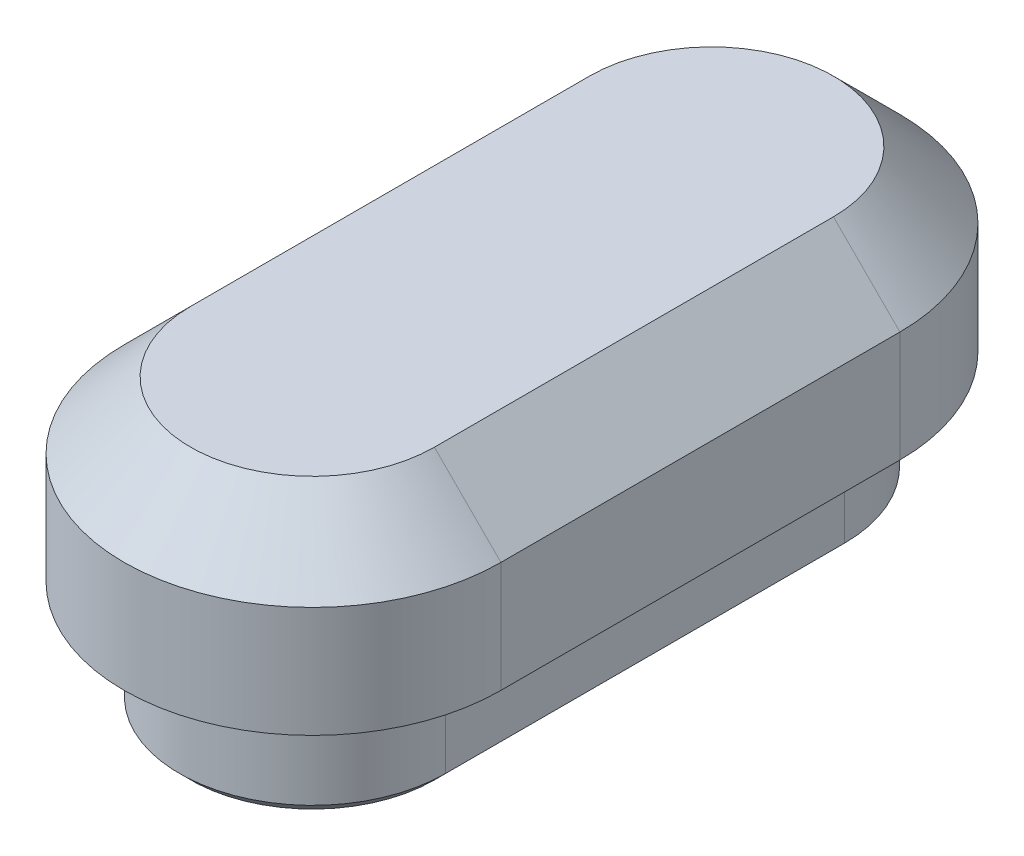
ISO-10303-21;
HEADER;
FILE_DESCRIPTION(('STEP AP214'),'2;1');
FILE_NAME('part.step','',(''),(''),'','','');
FILE_SCHEMA(('AUTOMOTIVE_DESIGN { 1 0 10303 214 1 1 1 1 }'));
ENDSEC;
DATA;
#1=APPLICATION_CONTEXT('core data for automotive mechanical design processes');
#2=APPLICATION_PROTOCOL_DEFINITION('international standard','automotive_design',2000,#1);
#3=PRODUCT_CONTEXT('',#1,'mechanical');
#4=PRODUCT('Part','Part','',(#3));
#5=PRODUCT_RELATED_PRODUCT_CATEGORY('part','',(#4));
#6=PRODUCT_DEFINITION_FORMATION('','',#4);
#7=PRODUCT_DEFINITION_CONTEXT('part definition',#1,'design');
#8=PRODUCT_DEFINITION('design','',#6,#7);
#9=PRODUCT_DEFINITION_SHAPE('','',#8);
#10=(LENGTH_UNIT() NAMED_UNIT(*) SI_UNIT(.MILLI.,.METRE.));
#11=(NAMED_UNIT(*) PLANE_ANGLE_UNIT() SI_UNIT($,.RADIAN.));
#12=(NAMED_UNIT(*) SI_UNIT($,.STERADIAN.) SOLID_ANGLE_UNIT());
#13=UNCERTAINTY_MEASURE_WITH_UNIT(LENGTH_MEASURE(1.E-05),#10,'distance_accuracy_value','');
#14=(GEOMETRIC_REPRESENTATION_CONTEXT(3) GLOBAL_UNCERTAINTY_ASSIGNED_CONTEXT((#13)) GLOBAL_UNIT_ASSIGNED_CONTEXT((#10,
#11,#12)) REPRESENTATION_CONTEXT('',''));
#15=CARTESIAN_POINT('',(0.,0.,0.));
#16=DIRECTION('',(0.,0.,1.));
#17=DIRECTION('',(1.,0.,0.));
#18=AXIS2_PLACEMENT_3D('',#15,#16,#17);
#19=CARTESIAN_POINT('',(0.,0.,-8.99999999999999));
#20=DIRECTION('',(0.,1.,0.));
#21=DIRECTION('',(0.,0.,1.));
#22=AXIS2_PLACEMENT_3D('',#19,#20,#21);
#23=PLANE('',#22);
#24=CARTESIAN_POINT('',(0.,0.,-8.99999999999999));
#25=DIRECTION('',(0.,1.,0.));
#26=DIRECTION('',(0.,0.,1.));
#27=AXIS2_PLACEMENT_3D('',#24,#25,#26);
#28=CIRCLE('',#27,8.50000000000001);
#29=CARTESIAN_POINT('',(8.50000000000001,0.,-8.99999999999999));
#30=VERTEX_POINT('',#29);
#31=CARTESIAN_POINT('',(-8.50000000000001,0.,-8.99999999999999));
#32=VERTEX_POINT('',#31);
#33=EDGE_CURVE('E244',#30,#32,#28,.T.);
#34=ORIENTED_EDGE('',*,*,#33,.F.);
#35=DIRECTION('',(0.,0.,-1.));
#36=VECTOR('',#35,1.);
#37=CARTESIAN_POINT('',(8.50000000000001,0.,-8.99999999999999));
#38=LINE('',#37,#36);
#39=CARTESIAN_POINT('',(8.50000000000001,0.,8.99999999999999));
#40=VERTEX_POINT('',#39);
#41=EDGE_CURVE('E253',#40,#30,#38,.T.);
#42=ORIENTED_EDGE('',*,*,#41,.F.);
#43=CARTESIAN_POINT('',(0.,0.,8.99999999999999));
#44=DIRECTION('',(0.,1.,0.));
#45=DIRECTION('',(0.,0.,1.));
#46=AXIS2_PLACEMENT_3D('',#43,#44,#45);
#47=CIRCLE('',#46,8.50000000000001);
#48=CARTESIAN_POINT('',(-8.50000000000001,0.,8.99999999999999));
#49=VERTEX_POINT('',#48);
#50=EDGE_CURVE('E250',#49,#40,#47,.T.);
#51=ORIENTED_EDGE('',*,*,#50,.F.);
#52=DIRECTION('',(0.,0.,1.));
#53=VECTOR('',#52,1.);
#54=CARTESIAN_POINT('',(-8.50000000000001,0.,-8.99999999999999));
#55=LINE('',#54,#53);
#56=EDGE_CURVE('E247',#32,#49,#55,.T.);
#57=ORIENTED_EDGE('',*,*,#56,.F.);
#58=EDGE_LOOP('',(#34,#42,#51,#57));
#59=FACE_BOUND('',#58,.T.);
#60=CARTESIAN_POINT('',(0.,0.,-8.99999999999999));
#61=DIRECTION('',(0.,-1.,0.));
#62=DIRECTION('',(0.,0.,-1.));
#63=AXIS2_PLACEMENT_3D('',#60,#61,#62);
#64=CIRCLE('',#63,6.00000000000001);
#65=CARTESIAN_POINT('',(-6.00000000000001,0.,-8.99999999999999));
#66=VERTEX_POINT('',#65);
#67=CARTESIAN_POINT('',(6.00000000000001,0.,-8.99999999999999));
#68=VERTEX_POINT('',#67);
#69=EDGE_CURVE('E184',#66,#68,#64,.T.);
#70=ORIENTED_EDGE('',*,*,#69,.F.);
#71=DIRECTION('',(0.,0.,-1.));
#72=VECTOR('',#71,1.);
#73=CARTESIAN_POINT('',(-6.00000000000001,0.,-8.99999999999999));
#74=LINE('',#73,#72);
#75=CARTESIAN_POINT('',(-6.00000000000001,0.,8.99999999999999));
#76=VERTEX_POINT('',#75);
#77=EDGE_CURVE('E193',#76,#66,#74,.T.);
#78=ORIENTED_EDGE('',*,*,#77,.F.);
#79=CARTESIAN_POINT('',(0.,0.,8.99999999999999));
#80=DIRECTION('',(0.,-1.,0.));
#81=DIRECTION('',(0.,0.,-1.));
#82=AXIS2_PLACEMENT_3D('',#79,#80,#81);
#83=CIRCLE('',#82,6.00000000000001);
#84=CARTESIAN_POINT('',(6.00000000000001,0.,8.99999999999999));
#85=VERTEX_POINT('',#84);
#86=EDGE_CURVE('E190',#85,#76,#83,.T.);
#87=ORIENTED_EDGE('',*,*,#86,.F.);
#88=DIRECTION('',(0.,0.,1.));
#89=VECTOR('',#88,1.);
#90=CARTESIAN_POINT('',(6.00000000000001,0.,8.99999999999999));
#91=LINE('',#90,#89);
#92=EDGE_CURVE('E187',#68,#85,#91,.T.);
#93=ORIENTED_EDGE('',*,*,#92,.F.);
#94=EDGE_LOOP('',(#70,#78,#87,#93));
#95=FACE_BOUND('',#94,.T.);
#96=ADVANCED_FACE('F27',(#59,#95),#23,.F.);
#97=CARTESIAN_POINT('',(0.,8.,-8.99999999999999));
#98=DIRECTION('',(0.,-1.,0.));
#99=DIRECTION('',(0.,0.,-1.));
#100=AXIS2_PLACEMENT_3D('',#97,#98,#99);
#101=CYLINDRICAL_SURFACE('',#100,8.50000000000001);
#102=DIRECTION('',(0.,-1.,0.));
#103=VECTOR('',#102,1.);
#104=CARTESIAN_POINT('',(-8.50000000000001,8.,-8.99999999999999));
#105=LINE('',#104,#103);
#106=CARTESIAN_POINT('',(-8.50000000000001,4.99999999999999,-8.99999999999999));
#107=VERTEX_POINT('',#106);
#108=EDGE_CURVE('E262',#107,#32,#105,.T.);
#109=ORIENTED_EDGE('',*,*,#108,.F.);
#110=CARTESIAN_POINT('',(0.,4.99999999999999,-8.99999999999999));
#111=DIRECTION('',(0.,1.,0.));
#112=DIRECTION('',(0.,0.,1.));
#113=AXIS2_PLACEMENT_3D('',#110,#111,#112);
#114=CIRCLE('',#113,8.50000000000001);
#115=CARTESIAN_POINT('',(8.50000000000001,4.99999999999999,-8.99999999999999));
#116=VERTEX_POINT('',#115);
#117=EDGE_CURVE('E280',#107,#116,#114,.F.);
#118=ORIENTED_EDGE('',*,*,#117,.T.);
#119=DIRECTION('',(0.,-1.,0.));
#120=VECTOR('',#119,1.);
#121=CARTESIAN_POINT('',(8.50000000000001,8.,-8.99999999999999));
#122=LINE('',#121,#120);
#123=EDGE_CURVE('E256',#116,#30,#122,.T.);
#124=ORIENTED_EDGE('',*,*,#123,.T.);
#125=ORIENTED_EDGE('',*,*,#33,.T.);
#126=EDGE_LOOP('',(#109,#118,#124,#125));
#127=FACE_BOUND('',#126,.T.);
#128=ADVANCED_FACE('F29',(#127),#101,.T.);
#129=CARTESIAN_POINT('',(-8.50000000000001,8.,-8.99999999999999));
#130=DIRECTION('',(1.,0.,0.));
#131=DIRECTION('',(0.,0.,-1.));
#132=AXIS2_PLACEMENT_3D('',#129,#130,#131);
#133=PLANE('',#132);
#134=DIRECTION('',(0.,-1.,0.));
#135=VECTOR('',#134,1.);
#136=CARTESIAN_POINT('',(-8.50000000000001,8.,8.99999999999999));
#137=LINE('',#136,#135);
#138=CARTESIAN_POINT('',(-8.50000000000001,4.99999999999999,8.99999999999999));
#139=VERTEX_POINT('',#138);
#140=EDGE_CURVE('E260',#139,#49,#137,.T.);
#141=ORIENTED_EDGE('',*,*,#140,.F.);
#142=DIRECTION('',(0.,0.,-1.));
#143=VECTOR('',#142,1.);
#144=CARTESIAN_POINT('',(-8.50000000000001,4.99999999999999,-8.99999999999999));
#145=LINE('',#144,#143);
#146=EDGE_CURVE('E278',#139,#107,#145,.T.);
#147=ORIENTED_EDGE('',*,*,#146,.T.);
#148=ORIENTED_EDGE('',*,*,#108,.T.);
#149=ORIENTED_EDGE('',*,*,#56,.T.);
#150=EDGE_LOOP('',(#141,#147,#148,#149));
#151=FACE_BOUND('',#150,.T.);
#152=ADVANCED_FACE('F347',(#151),#133,.F.);
#153=CARTESIAN_POINT('',(0.,8.,8.99999999999999));
#154=DIRECTION('',(0.,-1.,0.));
#155=DIRECTION('',(0.,0.,-1.));
#156=AXIS2_PLACEMENT_3D('',#153,#154,#155);
#157=CYLINDRICAL_SURFACE('',#156,8.50000000000001);
#158=DIRECTION('',(0.,-1.,0.));
#159=VECTOR('',#158,1.);
#160=CARTESIAN_POINT('',(8.50000000000001,8.,8.99999999999999));
#161=LINE('',#160,#159);
#162=CARTESIAN_POINT('',(8.50000000000001,4.99999999999999,8.99999999999999));
#163=VERTEX_POINT('',#162);
#164=EDGE_CURVE('E258',#163,#40,#161,.T.);
#165=ORIENTED_EDGE('',*,*,#164,.F.);
#166=CARTESIAN_POINT('',(0.,4.99999999999999,8.99999999999999));
#167=DIRECTION('',(0.,1.,0.));
#168=DIRECTION('',(0.,0.,1.));
#169=AXIS2_PLACEMENT_3D('',#166,#167,#168);
#170=CIRCLE('',#169,8.50000000000001);
#171=EDGE_CURVE('E276',#163,#139,#170,.F.);
#172=ORIENTED_EDGE('',*,*,#171,.T.);
#173=ORIENTED_EDGE('',*,*,#140,.T.);
#174=ORIENTED_EDGE('',*,*,#50,.T.);
#175=EDGE_LOOP('',(#165,#172,#173,#174));
#176=FACE_BOUND('',#175,.T.);
#177=ADVANCED_FACE('F361',(#176),#157,.T.);
#178=CARTESIAN_POINT('',(8.50000000000001,8.,-8.99999999999999));
#179=DIRECTION('',(-1.,0.,0.));
#180=DIRECTION('',(0.,0.,1.));
#181=AXIS2_PLACEMENT_3D('',#178,#179,#180);
#182=PLANE('',#181);
#183=ORIENTED_EDGE('',*,*,#123,.F.);
#184=DIRECTION('',(0.,0.,1.));
#185=VECTOR('',#184,1.);
#186=CARTESIAN_POINT('',(8.50000000000001,4.99999999999999,8.99999999999999));
#187=LINE('',#186,#185);
#188=EDGE_CURVE('E273',#116,#163,#187,.T.);
#189=ORIENTED_EDGE('',*,*,#188,.T.);
#190=ORIENTED_EDGE('',*,*,#164,.T.);
#191=ORIENTED_EDGE('',*,*,#41,.T.);
#192=EDGE_LOOP('',(#183,#189,#190,#191));
#193=FACE_BOUND('',#192,.T.);
#194=ADVANCED_FACE('F357',(#193),#182,.F.);
#195=CARTESIAN_POINT('',(0.,8.,-8.99999999999999));
#196=DIRECTION('',(0.,1.,0.));
#197=DIRECTION('',(0.,0.,1.));
#198=AXIS2_PLACEMENT_3D('',#195,#196,#197);
#199=PLANE('',#198);
#200=CARTESIAN_POINT('',(0.,8.,8.99999999999999));
#201=DIRECTION('',(0.,1.,0.));
#202=DIRECTION('',(0.,0.,1.));
#203=AXIS2_PLACEMENT_3D('',#200,#201,#202);
#204=CIRCLE('',#203,5.50000000000001);
#205=CARTESIAN_POINT('',(-5.50000000000001,8.,8.99999999999999));
#206=VERTEX_POINT('',#205);
#207=CARTESIAN_POINT('',(5.50000000000001,8.,8.99999999999999));
#208=VERTEX_POINT('',#207);
#209=EDGE_CURVE('E268',#206,#208,#204,.T.);
#210=ORIENTED_EDGE('',*,*,#209,.T.);
#211=DIRECTION('',(0.,0.,-1.));
#212=VECTOR('',#211,1.);
#213=CARTESIAN_POINT('',(5.50000000000001,8.,-8.99999999999999));
#214=LINE('',#213,#212);
#215=CARTESIAN_POINT('',(5.50000000000001,8.,-8.99999999999999));
#216=VERTEX_POINT('',#215);
#217=EDGE_CURVE('E270',#208,#216,#214,.T.);
#218=ORIENTED_EDGE('',*,*,#217,.T.);
#219=CARTESIAN_POINT('',(0.,8.,-8.99999999999999));
#220=DIRECTION('',(0.,1.,0.));
#221=DIRECTION('',(0.,0.,1.));
#222=AXIS2_PLACEMENT_3D('',#219,#220,#221);
#223=CIRCLE('',#222,5.50000000000001);
#224=CARTESIAN_POINT('',(-5.50000000000001,8.,-8.99999999999999));
#225=VERTEX_POINT('',#224);
#226=EDGE_CURVE('E264',#216,#225,#223,.T.);
#227=ORIENTED_EDGE('',*,*,#226,.T.);
#228=DIRECTION('',(0.,0.,1.));
#229=VECTOR('',#228,1.);
#230=CARTESIAN_POINT('',(-5.50000000000001,8.,8.99999999999999));
#231=LINE('',#230,#229);
#232=EDGE_CURVE('E266',#225,#206,#231,.T.);
#233=ORIENTED_EDGE('',*,*,#232,.T.);
#234=EDGE_LOOP('',(#210,#218,#227,#233));
#235=FACE_BOUND('',#234,.T.);
#236=ADVANCED_FACE('F354',(#235),#199,.T.);
#237=CARTESIAN_POINT('',(-5.50000000000001,8.,-8.99999999999999));
#238=DIRECTION('',(-0.707106781186548,0.707106781186547,0.));
#239=DIRECTION('',(-0.707106781186547,-0.707106781186548,0.));
#240=AXIS2_PLACEMENT_3D('',#237,#238,#239);
#241=PLANE('',#240);
#242=DIRECTION('',(0.707106781186547,0.707106781186548,0.));
#243=VECTOR('',#242,1.);
#244=CARTESIAN_POINT('',(-8.50000000000001,4.99999999999999,-8.99999999999999));
#245=LINE('',#244,#243);
#246=EDGE_CURVE('E238',#107,#225,#245,.T.);
#247=ORIENTED_EDGE('',*,*,#246,.F.);
#248=ORIENTED_EDGE('',*,*,#146,.F.);
#249=DIRECTION('',(-0.707106781186547,-0.707106781186548,0.));
#250=VECTOR('',#249,1.);
#251=CARTESIAN_POINT('',(-5.50000000000001,8.,8.99999999999999));
#252=LINE('',#251,#250);
#253=EDGE_CURVE('E241',#206,#139,#252,.T.);
#254=ORIENTED_EDGE('',*,*,#253,.F.);
#255=ORIENTED_EDGE('',*,*,#232,.F.);
#256=EDGE_LOOP('',(#247,#248,#254,#255));
#257=FACE_BOUND('',#256,.T.);
#258=ADVANCED_FACE('F352',(#257),#241,.T.);
#259=CARTESIAN_POINT('',(0.,8.,8.99999999999999));
#260=DIRECTION('',(0.,-1.,0.));
#261=DIRECTION('',(0.,0.,-1.));
#262=AXIS2_PLACEMENT_3D('',#259,#260,#261);
#263=CONICAL_SURFACE('',#262,5.50000000000001,0.785398163397447);
#264=ORIENTED_EDGE('',*,*,#253,.T.);
#265=ORIENTED_EDGE('',*,*,#171,.F.);
#266=DIRECTION('',(0.707106781186547,-0.707106781186548,0.));
#267=VECTOR('',#266,1.);
#268=CARTESIAN_POINT('',(5.50000000000001,8.,8.99999999999999));
#269=LINE('',#268,#267);
#270=EDGE_CURVE('E236',#208,#163,#269,.T.);
#271=ORIENTED_EDGE('',*,*,#270,.F.);
#272=ORIENTED_EDGE('',*,*,#209,.F.);
#273=EDGE_LOOP('',(#264,#265,#271,#272));
#274=FACE_BOUND('',#273,.T.);
#275=ADVANCED_FACE('F382',(#274),#263,.T.);
#276=CARTESIAN_POINT('',(0.,8.,-8.99999999999999));
#277=DIRECTION('',(0.,-1.,0.));
#278=DIRECTION('',(0.,0.,-1.));
#279=AXIS2_PLACEMENT_3D('',#276,#277,#278);
#280=CONICAL_SURFACE('',#279,5.50000000000001,0.785398163397447);
#281=ORIENTED_EDGE('',*,*,#246,.T.);
#282=ORIENTED_EDGE('',*,*,#226,.F.);
#283=DIRECTION('',(-0.707106781186547,0.707106781186549,0.));
#284=VECTOR('',#283,1.);
#285=CARTESIAN_POINT('',(8.50000000000001,4.99999999999999,-8.99999999999999));
#286=LINE('',#285,#284);
#287=EDGE_CURVE('E209',#116,#216,#286,.T.);
#288=ORIENTED_EDGE('',*,*,#287,.F.);
#289=ORIENTED_EDGE('',*,*,#117,.F.);
#290=EDGE_LOOP('',(#281,#282,#288,#289));
#291=FACE_BOUND('',#290,.T.);
#292=ADVANCED_FACE('F387',(#291),#280,.T.);
#293=CARTESIAN_POINT('',(5.50000000000001,8.,-8.99999999999999));
#294=DIRECTION('',(0.707106781186548,0.707106781186547,0.));
#295=DIRECTION('',(-0.707106781186547,0.707106781186548,0.));
#296=AXIS2_PLACEMENT_3D('',#293,#294,#295);
#297=PLANE('',#296);
#298=ORIENTED_EDGE('',*,*,#270,.T.);
#299=ORIENTED_EDGE('',*,*,#188,.F.);
#300=ORIENTED_EDGE('',*,*,#287,.T.);
#301=ORIENTED_EDGE('',*,*,#217,.F.);
#302=EDGE_LOOP('',(#298,#299,#300,#301));
#303=FACE_BOUND('',#302,.T.);
#304=ADVANCED_FACE('F394',(#303),#297,.T.);
#305=CARTESIAN_POINT('',(0.,-5.,-8.99999999999999));
#306=DIRECTION('',(0.,-1.,0.));
#307=DIRECTION('',(0.,0.,-1.));
#308=AXIS2_PLACEMENT_3D('',#305,#306,#307);
#309=PLANE('',#308);
#310=DIRECTION('',(0.,0.,1.));
#311=VECTOR('',#310,1.);
#312=CARTESIAN_POINT('',(5.50000000000001,-5.,8.99999999999999));
#313=LINE('',#312,#311);
#314=CARTESIAN_POINT('',(5.50000000000001,-5.,-8.99999999999999));
#315=VERTEX_POINT('',#314);
#316=CARTESIAN_POINT('',(5.50000000000001,-5.,8.99999999999999));
#317=VERTEX_POINT('',#316);
#318=EDGE_CURVE('E286',#315,#317,#313,.T.);
#319=ORIENTED_EDGE('',*,*,#318,.T.);
#320=CARTESIAN_POINT('',(0.,-5.,8.99999999999999));
#321=DIRECTION('',(0.,-1.,0.));
#322=DIRECTION('',(0.,0.,-1.));
#323=AXIS2_PLACEMENT_3D('',#320,#321,#322);
#324=CIRCLE('',#323,5.50000000000001);
#325=CARTESIAN_POINT('',(-5.50000000000001,-5.,8.99999999999999));
#326=VERTEX_POINT('',#325);
#327=EDGE_CURVE('E288',#317,#326,#324,.T.);
#328=ORIENTED_EDGE('',*,*,#327,.T.);
#329=DIRECTION('',(0.,0.,-1.));
#330=VECTOR('',#329,1.);
#331=CARTESIAN_POINT('',(-5.50000000000001,-5.,-8.99999999999999));
#332=LINE('',#331,#330);
#333=CARTESIAN_POINT('',(-5.50000000000001,-5.,-8.99999999999999));
#334=VERTEX_POINT('',#333);
#335=EDGE_CURVE('E282',#326,#334,#332,.T.);
#336=ORIENTED_EDGE('',*,*,#335,.T.);
#337=CARTESIAN_POINT('',(0.,-5.,-8.99999999999999));
#338=DIRECTION('',(0.,-1.,0.));
#339=DIRECTION('',(0.,0.,-1.));
#340=AXIS2_PLACEMENT_3D('',#337,#338,#339);
#341=CIRCLE('',#340,5.50000000000001);
#342=EDGE_CURVE('E284',#334,#315,#341,.T.);
#343=ORIENTED_EDGE('',*,*,#342,.T.);
#344=EDGE_LOOP('',(#319,#328,#336,#343));
#345=FACE_BOUND('',#344,.T.);
#346=DIRECTION('',(0.,0.,-1.));
#347=VECTOR('',#346,1.);
#348=CARTESIAN_POINT('',(-4.50000000000001,-5.,-8.99999999999999));
#349=LINE('',#348,#347);
#350=CARTESIAN_POINT('',(-4.50000000000001,-5.,8.99999999999999));
#351=VERTEX_POINT('',#350);
#352=CARTESIAN_POINT('',(-4.50000000000001,-5.,-8.99999999999999));
#353=VERTEX_POINT('',#352);
#354=EDGE_CURVE('E157',#351,#353,#349,.T.);
#355=ORIENTED_EDGE('',*,*,#354,.F.);
#356=CARTESIAN_POINT('',(0.,-5.,8.99999999999999));
#357=DIRECTION('',(0.,-1.,0.));
#358=DIRECTION('',(0.,0.,-1.));
#359=AXIS2_PLACEMENT_3D('',#356,#357,#358);
#360=CIRCLE('',#359,4.50000000000001);
#361=CARTESIAN_POINT('',(4.50000000000001,-5.,8.99999999999999));
#362=VERTEX_POINT('',#361);
#363=EDGE_CURVE('E167',#362,#351,#360,.T.);
#364=ORIENTED_EDGE('',*,*,#363,.F.);
#365=DIRECTION('',(0.,0.,1.));
#366=VECTOR('',#365,1.);
#367=CARTESIAN_POINT('',(4.50000000000001,-5.,8.99999999999999));
#368=LINE('',#367,#366);
#369=CARTESIAN_POINT('',(4.50000000000001,-5.,-8.99999999999999));
#370=VERTEX_POINT('',#369);
#371=EDGE_CURVE('E179',#370,#362,#368,.T.);
#372=ORIENTED_EDGE('',*,*,#371,.F.);
#373=CARTESIAN_POINT('',(0.,-5.,-8.99999999999999));
#374=DIRECTION('',(0.,-1.,0.));
#375=DIRECTION('',(0.,0.,-1.));
#376=AXIS2_PLACEMENT_3D('',#373,#374,#375);
#377=CIRCLE('',#376,4.50000000000001);
#378=EDGE_CURVE('E177',#353,#370,#377,.T.);
#379=ORIENTED_EDGE('',*,*,#378,.F.);
#380=EDGE_LOOP('',(#355,#364,#372,#379));
#381=FACE_BOUND('',#380,.T.);
#382=ADVANCED_FACE('F175',(#345,#381),#309,.T.);
#383=CARTESIAN_POINT('',(0.,-5.,-8.99999999999999));
#384=DIRECTION('',(0.,1.,0.));
#385=DIRECTION('',(0.,0.,1.));
#386=AXIS2_PLACEMENT_3D('',#383,#384,#385);
#387=CYLINDRICAL_SURFACE('',#386,6.00000000000001);
#388=DIRECTION('',(0.,1.,0.));
#389=VECTOR('',#388,1.);
#390=CARTESIAN_POINT('',(6.00000000000001,-5.,-8.99999999999999));
#391=LINE('',#390,#389);
#392=CARTESIAN_POINT('',(6.00000000000001,-4.5,-8.99999999999999));
#393=VERTEX_POINT('',#392);
#394=EDGE_CURVE('E202',#393,#68,#391,.T.);
#395=ORIENTED_EDGE('',*,*,#394,.F.);
#396=CARTESIAN_POINT('',(0.,-4.5,-8.99999999999999));
#397=DIRECTION('',(0.,-1.,0.));
#398=DIRECTION('',(0.,0.,-1.));
#399=AXIS2_PLACEMENT_3D('',#396,#397,#398);
#400=CIRCLE('',#399,6.00000000000001);
#401=CARTESIAN_POINT('',(-6.00000000000001,-4.5,-8.99999999999999));
#402=VERTEX_POINT('',#401);
#403=EDGE_CURVE('E35',#393,#402,#400,.F.);
#404=ORIENTED_EDGE('',*,*,#403,.T.);
#405=DIRECTION('',(0.,1.,0.));
#406=VECTOR('',#405,1.);
#407=CARTESIAN_POINT('',(-6.00000000000001,-5.,-8.99999999999999));
#408=LINE('',#407,#406);
#409=EDGE_CURVE('E196',#402,#66,#408,.T.);
#410=ORIENTED_EDGE('',*,*,#409,.T.);
#411=ORIENTED_EDGE('',*,*,#69,.T.);
#412=EDGE_LOOP('',(#395,#404,#410,#411));
#413=FACE_BOUND('',#412,.T.);
#414=ADVANCED_FACE('F306',(#413),#387,.T.);
#415=CARTESIAN_POINT('',(6.00000000000001,-5.,8.99999999999999));
#416=DIRECTION('',(-1.,0.,0.));
#417=DIRECTION('',(0.,0.,1.));
#418=AXIS2_PLACEMENT_3D('',#415,#416,#417);
#419=PLANE('',#418);
#420=DIRECTION('',(0.,1.,0.));
#421=VECTOR('',#420,1.);
#422=CARTESIAN_POINT('',(6.00000000000001,-5.,8.99999999999999));
#423=LINE('',#422,#421);
#424=CARTESIAN_POINT('',(6.00000000000001,-4.5,8.99999999999999));
#425=VERTEX_POINT('',#424);
#426=EDGE_CURVE('E200',#425,#85,#423,.T.);
#427=ORIENTED_EDGE('',*,*,#426,.F.);
#428=DIRECTION('',(0.,0.,-1.));
#429=VECTOR('',#428,1.);
#430=CARTESIAN_POINT('',(6.00000000000001,-4.5,-8.99999999999999));
#431=LINE('',#430,#429);
#432=EDGE_CURVE('E49',#425,#393,#431,.T.);
#433=ORIENTED_EDGE('',*,*,#432,.T.);
#434=ORIENTED_EDGE('',*,*,#394,.T.);
#435=ORIENTED_EDGE('',*,*,#92,.T.);
#436=EDGE_LOOP('',(#427,#433,#434,#435));
#437=FACE_BOUND('',#436,.T.);
#438=ADVANCED_FACE('F301',(#437),#419,.F.);
#439=CARTESIAN_POINT('',(0.,-5.,8.99999999999999));
#440=DIRECTION('',(0.,1.,0.));
#441=DIRECTION('',(0.,0.,1.));
#442=AXIS2_PLACEMENT_3D('',#439,#440,#441);
#443=CYLINDRICAL_SURFACE('',#442,6.00000000000001);
#444=DIRECTION('',(0.,1.,0.));
#445=VECTOR('',#444,1.);
#446=CARTESIAN_POINT('',(-6.00000000000001,-5.,8.99999999999999));
#447=LINE('',#446,#445);
#448=CARTESIAN_POINT('',(-6.00000000000001,-4.5,8.99999999999999));
#449=VERTEX_POINT('',#448);
#450=EDGE_CURVE('E198',#449,#76,#447,.T.);
#451=ORIENTED_EDGE('',*,*,#450,.F.);
#452=CARTESIAN_POINT('',(0.,-4.5,8.99999999999999));
#453=DIRECTION('',(0.,-1.,0.));
#454=DIRECTION('',(0.,0.,-1.));
#455=AXIS2_PLACEMENT_3D('',#452,#453,#454);
#456=CIRCLE('',#455,6.00000000000001);
#457=EDGE_CURVE('E291',#449,#425,#456,.F.);
#458=ORIENTED_EDGE('',*,*,#457,.T.);
#459=ORIENTED_EDGE('',*,*,#426,.T.);
#460=ORIENTED_EDGE('',*,*,#86,.T.);
#461=EDGE_LOOP('',(#451,#458,#459,#460));
#462=FACE_BOUND('',#461,.T.);
#463=ADVANCED_FACE('F297',(#462),#443,.T.);
#464=CARTESIAN_POINT('',(-6.00000000000001,-5.,-8.99999999999999));
#465=DIRECTION('',(1.,0.,0.));
#466=DIRECTION('',(0.,0.,-1.));
#467=AXIS2_PLACEMENT_3D('',#464,#465,#466);
#468=PLANE('',#467);
#469=ORIENTED_EDGE('',*,*,#409,.F.);
#470=DIRECTION('',(0.,0.,1.));
#471=VECTOR('',#470,1.);
#472=CARTESIAN_POINT('',(-6.00000000000001,-4.5,8.99999999999999));
#473=LINE('',#472,#471);
#474=EDGE_CURVE('E11',#402,#449,#473,.T.);
#475=ORIENTED_EDGE('',*,*,#474,.T.);
#476=ORIENTED_EDGE('',*,*,#450,.T.);
#477=ORIENTED_EDGE('',*,*,#77,.T.);
#478=EDGE_LOOP('',(#469,#475,#476,#477));
#479=FACE_BOUND('',#478,.T.);
#480=ADVANCED_FACE('F309',(#479),#468,.F.);
#481=CARTESIAN_POINT('',(0.,4.,-8.99999999999999));
#482=DIRECTION('',(0.,1.,0.));
#483=DIRECTION('',(0.,0.,1.));
#484=AXIS2_PLACEMENT_3D('',#481,#482,#483);
#485=PLANE('',#484);
#486=CARTESIAN_POINT('',(0.,4.,8.99999999999999));
#487=DIRECTION('',(0.,1.,0.));
#488=DIRECTION('',(0.,0.,1.));
#489=AXIS2_PLACEMENT_3D('',#486,#487,#488);
#490=CIRCLE('',#489,3.84314575050763);
#491=CARTESIAN_POINT('',(-3.84314575050763,4.,8.99999999999999));
#492=VERTEX_POINT('',#491);
#493=CARTESIAN_POINT('',(3.84314575050763,4.,8.99999999999999));
#494=VERTEX_POINT('',#493);
#495=EDGE_CURVE('E225',#492,#494,#490,.T.);
#496=ORIENTED_EDGE('',*,*,#495,.F.);
#497=DIRECTION('',(0.,0.,1.));
#498=VECTOR('',#497,1.);
#499=CARTESIAN_POINT('',(-3.84314575050762,4.,-8.99999999999999));
#500=LINE('',#499,#498);
#501=CARTESIAN_POINT('',(-3.84314575050763,4.,-8.99999999999999));
#502=VERTEX_POINT('',#501);
#503=EDGE_CURVE('E227',#502,#492,#500,.T.);
#504=ORIENTED_EDGE('',*,*,#503,.F.);
#505=CARTESIAN_POINT('',(0.,4.,-8.99999999999999));
#506=DIRECTION('',(0.,1.,0.));
#507=DIRECTION('',(0.,0.,1.));
#508=AXIS2_PLACEMENT_3D('',#505,#506,#507);
#509=CIRCLE('',#508,3.84314575050763);
#510=CARTESIAN_POINT('',(3.84314575050763,4.,-8.99999999999999));
#511=VERTEX_POINT('',#510);
#512=EDGE_CURVE('E206',#511,#502,#509,.T.);
#513=ORIENTED_EDGE('',*,*,#512,.F.);
#514=DIRECTION('',(0.,0.,-1.));
#515=VECTOR('',#514,1.);
#516=CARTESIAN_POINT('',(3.84314575050763,4.,-8.99999999999999));
#517=LINE('',#516,#515);
#518=EDGE_CURVE('E220',#494,#511,#517,.T.);
#519=ORIENTED_EDGE('',*,*,#518,.F.);
#520=EDGE_LOOP('',(#496,#504,#513,#519));
#521=FACE_BOUND('',#520,.T.);
#522=ADVANCED_FACE('F479',(#521),#485,.F.);
#523=CARTESIAN_POINT('',(0.,5.17157287525381,-8.99999999999999));
#524=DIRECTION('',(0.,-1.,0.));
#525=DIRECTION('',(0.,0.,-1.));
#526=AXIS2_PLACEMENT_3D('',#523,#524,#525);
#527=CONICAL_SURFACE('',#526,2.67157287525382,0.785398163397447);
#528=DIRECTION('',(-0.707106781186547,-0.707106781186548,0.));
#529=VECTOR('',#528,1.);
#530=CARTESIAN_POINT('',(-2.67157287525382,5.17157287525381,-8.99999999999999));
#531=LINE('',#530,#529);
#532=CARTESIAN_POINT('',(-4.50000000000001,3.34314575050762,-8.99999999999999));
#533=VERTEX_POINT('',#532);
#534=EDGE_CURVE('E222',#533,#502,#531,.F.);
#535=ORIENTED_EDGE('',*,*,#534,.F.);
#536=CARTESIAN_POINT('',(0.,3.34314575050762,-8.99999999999999));
#537=DIRECTION('',(0.,-1.,0.));
#538=DIRECTION('',(0.,0.,-1.));
#539=AXIS2_PLACEMENT_3D('',#536,#537,#538);
#540=CIRCLE('',#539,4.50000000000001);
#541=CARTESIAN_POINT('',(4.50000000000001,3.34314575050762,-8.99999999999999));
#542=VERTEX_POINT('',#541);
#543=EDGE_CURVE('E207',#533,#542,#540,.T.);
#544=ORIENTED_EDGE('',*,*,#543,.T.);
#545=DIRECTION('',(-0.707106781186547,0.707106781186548,0.));
#546=VECTOR('',#545,1.);
#547=CARTESIAN_POINT('',(2.67157287525382,5.17157287525381,-8.99999999999999));
#548=LINE('',#547,#546);
#549=EDGE_CURVE('E204',#542,#511,#548,.T.);
#550=ORIENTED_EDGE('',*,*,#549,.T.);
#551=ORIENTED_EDGE('',*,*,#512,.T.);
#552=EDGE_LOOP('',(#535,#544,#550,#551));
#553=FACE_BOUND('',#552,.T.);
#554=ADVANCED_FACE('F483',(#553),#527,.F.);
#555=CARTESIAN_POINT('',(-2.67157287525382,5.17157287525381,-8.99999999999999));
#556=DIRECTION('',(-0.707106781186548,0.707106781186547,0.));
#557=DIRECTION('',(-0.707106781186547,-0.707106781186548,0.));
#558=AXIS2_PLACEMENT_3D('',#555,#556,#557);
#559=PLANE('',#558);
#560=ORIENTED_EDGE('',*,*,#534,.T.);
#561=ORIENTED_EDGE('',*,*,#503,.T.);
#562=DIRECTION('',(-0.707106781186547,-0.707106781186548,0.));
#563=VECTOR('',#562,1.);
#564=CARTESIAN_POINT('',(-2.67157287525382,5.17157287525381,8.99999999999999));
#565=LINE('',#564,#563);
#566=CARTESIAN_POINT('',(-4.50000000000001,3.34314575050762,8.99999999999999));
#567=VERTEX_POINT('',#566);
#568=EDGE_CURVE('E211',#492,#567,#565,.T.);
#569=ORIENTED_EDGE('',*,*,#568,.T.);
#570=DIRECTION('',(0.,0.,-1.));
#571=VECTOR('',#570,1.);
#572=CARTESIAN_POINT('',(-4.50000000000001,3.34314575050762,-8.99999999999999));
#573=LINE('',#572,#571);
#574=EDGE_CURVE('E159',#567,#533,#573,.T.);
#575=ORIENTED_EDGE('',*,*,#574,.T.);
#576=EDGE_LOOP('',(#560,#561,#569,#575));
#577=FACE_BOUND('',#576,.T.);
#578=ADVANCED_FACE('F488',(#577),#559,.F.);
#579=CARTESIAN_POINT('',(0.,5.17157287525381,8.99999999999999));
#580=DIRECTION('',(0.,-1.,0.));
#581=DIRECTION('',(0.,0.,-1.));
#582=AXIS2_PLACEMENT_3D('',#579,#580,#581);
#583=CONICAL_SURFACE('',#582,2.67157287525382,0.785398163397447);
#584=ORIENTED_EDGE('',*,*,#568,.F.);
#585=ORIENTED_EDGE('',*,*,#495,.T.);
#586=DIRECTION('',(-0.707106781186547,0.707106781186548,0.));
#587=VECTOR('',#586,1.);
#588=CARTESIAN_POINT('',(2.67157287525382,5.17157287525381,8.99999999999999));
#589=LINE('',#588,#587);
#590=CARTESIAN_POINT('',(4.50000000000001,3.34314575050762,8.99999999999999));
#591=VERTEX_POINT('',#590);
#592=EDGE_CURVE('E223',#494,#591,#589,.F.);
#593=ORIENTED_EDGE('',*,*,#592,.T.);
#594=CARTESIAN_POINT('',(0.,3.34314575050762,8.99999999999999));
#595=DIRECTION('',(0.,-1.,0.));
#596=DIRECTION('',(0.,0.,-1.));
#597=AXIS2_PLACEMENT_3D('',#594,#595,#596);
#598=CIRCLE('',#597,4.50000000000001);
#599=EDGE_CURVE('E214',#591,#567,#598,.T.);
#600=ORIENTED_EDGE('',*,*,#599,.T.);
#601=EDGE_LOOP('',(#584,#585,#593,#600));
#602=FACE_BOUND('',#601,.T.);
#603=ADVANCED_FACE('F492',(#602),#583,.F.);
#604=CARTESIAN_POINT('',(2.67157287525382,5.17157287525381,-8.99999999999999));
#605=DIRECTION('',(0.707106781186548,0.707106781186547,0.));
#606=DIRECTION('',(-0.707106781186547,0.707106781186548,0.));
#607=AXIS2_PLACEMENT_3D('',#604,#605,#606);
#608=PLANE('',#607);
#609=ORIENTED_EDGE('',*,*,#592,.F.);
#610=ORIENTED_EDGE('',*,*,#518,.T.);
#611=ORIENTED_EDGE('',*,*,#549,.F.);
#612=DIRECTION('',(0.,0.,1.));
#613=VECTOR('',#612,1.);
#614=CARTESIAN_POINT('',(4.50000000000001,3.34314575050762,-8.99999999999999));
#615=LINE('',#614,#613);
#616=EDGE_CURVE('E217',#542,#591,#615,.T.);
#617=ORIENTED_EDGE('',*,*,#616,.T.);
#618=EDGE_LOOP('',(#609,#610,#611,#617));
#619=FACE_BOUND('',#618,.T.);
#620=ADVANCED_FACE('F405',(#619),#608,.F.);
#621=CARTESIAN_POINT('',(4.50000000000001,8.,-8.99999999999999));
#622=DIRECTION('',(-1.,0.,0.));
#623=DIRECTION('',(0.,0.,1.));
#624=AXIS2_PLACEMENT_3D('',#621,#622,#623);
#625=PLANE('',#624);
#626=DIRECTION('',(0.,-1.,0.));
#627=VECTOR('',#626,1.);
#628=CARTESIAN_POINT('',(4.50000000000001,8.,-8.99999999999999));
#629=LINE('',#628,#627);
#630=EDGE_CURVE('E210',#542,#370,#629,.T.);
#631=ORIENTED_EDGE('',*,*,#630,.T.);
#632=ORIENTED_EDGE('',*,*,#371,.T.);
#633=DIRECTION('',(0.,1.,0.));
#634=VECTOR('',#633,1.);
#635=CARTESIAN_POINT('',(4.50000000000001,8.,8.99999999999999));
#636=LINE('',#635,#634);
#637=EDGE_CURVE('E164',#591,#362,#636,.F.);
#638=ORIENTED_EDGE('',*,*,#637,.F.);
#639=ORIENTED_EDGE('',*,*,#616,.F.);
#640=EDGE_LOOP('',(#631,#632,#638,#639));
#641=FACE_BOUND('',#640,.T.);
#642=ADVANCED_FACE('F466',(#641),#625,.T.);
#643=CARTESIAN_POINT('',(0.,8.,8.99999999999999));
#644=DIRECTION('',(0.,-1.,0.));
#645=DIRECTION('',(0.,0.,-1.));
#646=AXIS2_PLACEMENT_3D('',#643,#644,#645);
#647=CYLINDRICAL_SURFACE('',#646,4.50000000000001);
#648=ORIENTED_EDGE('',*,*,#637,.T.);
#649=ORIENTED_EDGE('',*,*,#363,.T.);
#650=DIRECTION('',(0.,-1.,0.));
#651=VECTOR('',#650,1.);
#652=CARTESIAN_POINT('',(-4.50000000000001,8.,8.99999999999999));
#653=LINE('',#652,#651);
#654=EDGE_CURVE('E152',#567,#351,#653,.T.);
#655=ORIENTED_EDGE('',*,*,#654,.F.);
#656=ORIENTED_EDGE('',*,*,#599,.F.);
#657=EDGE_LOOP('',(#648,#649,#655,#656));
#658=FACE_BOUND('',#657,.T.);
#659=ADVANCED_FACE('F168',(#658),#647,.F.);
#660=CARTESIAN_POINT('',(-4.50000000000001,8.,-8.99999999999999));
#661=DIRECTION('',(1.,0.,0.));
#662=DIRECTION('',(0.,0.,-1.));
#663=AXIS2_PLACEMENT_3D('',#660,#661,#662);
#664=PLANE('',#663);
#665=ORIENTED_EDGE('',*,*,#654,.T.);
#666=ORIENTED_EDGE('',*,*,#354,.T.);
#667=DIRECTION('',(0.,1.,0.));
#668=VECTOR('',#667,1.);
#669=CARTESIAN_POINT('',(-4.50000000000001,8.,-8.99999999999999));
#670=LINE('',#669,#668);
#671=EDGE_CURVE('E163',#533,#353,#670,.F.);
#672=ORIENTED_EDGE('',*,*,#671,.F.);
#673=ORIENTED_EDGE('',*,*,#574,.F.);
#674=EDGE_LOOP('',(#665,#666,#672,#673));
#675=FACE_BOUND('',#674,.T.);
#676=ADVANCED_FACE('F154',(#675),#664,.T.);
#677=CARTESIAN_POINT('',(0.,8.,-8.99999999999999));
#678=DIRECTION('',(0.,-1.,0.));
#679=DIRECTION('',(0.,0.,-1.));
#680=AXIS2_PLACEMENT_3D('',#677,#678,#679);
#681=CYLINDRICAL_SURFACE('',#680,4.50000000000001);
#682=ORIENTED_EDGE('',*,*,#671,.T.);
#683=ORIENTED_EDGE('',*,*,#378,.T.);
#684=ORIENTED_EDGE('',*,*,#630,.F.);
#685=ORIENTED_EDGE('',*,*,#543,.F.);
#686=EDGE_LOOP('',(#682,#683,#684,#685));
#687=FACE_BOUND('',#686,.T.);
#688=ADVANCED_FACE('F442',(#687),#681,.F.);
#689=CARTESIAN_POINT('',(0.,-5.,-8.99999999999999));
#690=DIRECTION('',(0.,1.,0.));
#691=DIRECTION('',(0.,0.,1.));
#692=AXIS2_PLACEMENT_3D('',#689,#690,#691);
#693=CONICAL_SURFACE('',#692,5.50000000000001,0.785398163397445);
#694=DIRECTION('',(0.707106781186545,-0.70710678118655,0.));
#695=VECTOR('',#694,1.);
#696=CARTESIAN_POINT('',(-6.00000000000001,-4.5,-8.99999999999999));
#697=LINE('',#696,#695);
#698=EDGE_CURVE('E314',#402,#334,#697,.T.);
#699=ORIENTED_EDGE('',*,*,#698,.F.);
#700=ORIENTED_EDGE('',*,*,#403,.F.);
#701=DIRECTION('',(0.707106781186545,0.70710678118655,0.));
#702=VECTOR('',#701,1.);
#703=CARTESIAN_POINT('',(5.50000000000001,-5.,-8.99999999999999));
#704=LINE('',#703,#702);
#705=EDGE_CURVE('E173',#315,#393,#704,.T.);
#706=ORIENTED_EDGE('',*,*,#705,.F.);
#707=ORIENTED_EDGE('',*,*,#342,.F.);
#708=EDGE_LOOP('',(#699,#700,#706,#707));
#709=FACE_BOUND('',#708,.T.);
#710=ADVANCED_FACE('F315',(#709),#693,.T.);
#711=CARTESIAN_POINT('',(5.50000000000001,-5.,-8.99999999999999));
#712=DIRECTION('',(0.70710678118655,-0.707106781186545,0.));
#713=DIRECTION('',(0.707106781186545,0.70710678118655,0.));
#714=AXIS2_PLACEMENT_3D('',#711,#712,#713);
#715=PLANE('',#714);
#716=ORIENTED_EDGE('',*,*,#705,.T.);
#717=ORIENTED_EDGE('',*,*,#432,.F.);
#718=DIRECTION('',(0.707106781186545,0.70710678118655,0.));
#719=VECTOR('',#718,1.);
#720=CARTESIAN_POINT('',(5.50000000000001,-5.,8.99999999999999));
#721=LINE('',#720,#719);
#722=EDGE_CURVE('E320',#317,#425,#721,.T.);
#723=ORIENTED_EDGE('',*,*,#722,.F.);
#724=ORIENTED_EDGE('',*,*,#318,.F.);
#725=EDGE_LOOP('',(#716,#717,#723,#724));
#726=FACE_BOUND('',#725,.T.);
#727=ADVANCED_FACE('F329',(#726),#715,.T.);
#728=CARTESIAN_POINT('',(-5.50000000000001,-5.,-8.99999999999999));
#729=DIRECTION('',(-0.70710678118655,-0.707106781186545,0.));
#730=DIRECTION('',(0.707106781186545,-0.70710678118655,0.));
#731=AXIS2_PLACEMENT_3D('',#728,#729,#730);
#732=PLANE('',#731);
#733=ORIENTED_EDGE('',*,*,#698,.T.);
#734=ORIENTED_EDGE('',*,*,#335,.F.);
#735=DIRECTION('',(0.707106781186545,-0.70710678118655,0.));
#736=VECTOR('',#735,1.);
#737=CARTESIAN_POINT('',(-6.00000000000001,-4.5,8.99999999999999));
#738=LINE('',#737,#736);
#739=EDGE_CURVE('E323',#449,#326,#738,.T.);
#740=ORIENTED_EDGE('',*,*,#739,.F.);
#741=ORIENTED_EDGE('',*,*,#474,.F.);
#742=EDGE_LOOP('',(#733,#734,#740,#741));
#743=FACE_BOUND('',#742,.T.);
#744=ADVANCED_FACE('F322',(#743),#732,.T.);
#745=CARTESIAN_POINT('',(0.,-5.,8.99999999999999));
#746=DIRECTION('',(0.,1.,0.));
#747=DIRECTION('',(0.,0.,1.));
#748=AXIS2_PLACEMENT_3D('',#745,#746,#747);
#749=CONICAL_SURFACE('',#748,5.50000000000001,0.785398163397445);
#750=ORIENTED_EDGE('',*,*,#722,.T.);
#751=ORIENTED_EDGE('',*,*,#457,.F.);
#752=ORIENTED_EDGE('',*,*,#739,.T.);
#753=ORIENTED_EDGE('',*,*,#327,.F.);
#754=EDGE_LOOP('',(#750,#751,#752,#753));
#755=FACE_BOUND('',#754,.T.);
#756=ADVANCED_FACE('F332',(#755),#749,.T.);
#757=CLOSED_SHELL('',(#96,#128,#152,#177,#194,#236,#258,#275,#292,#304,#382,#414,#438,#463,#480,
#522,#554,#578,#603,#620,#642,#659,#676,#688,#710,#727,#744,#756));
#758=MANIFOLD_SOLID_BREP('B2',#757);
#759=ADVANCED_BREP_SHAPE_REPRESENTATION('',(#18,#758),#14);
#760=SHAPE_DEFINITION_REPRESENTATION(#9,#759);
ENDSEC;
END-ISO-10303-21;
